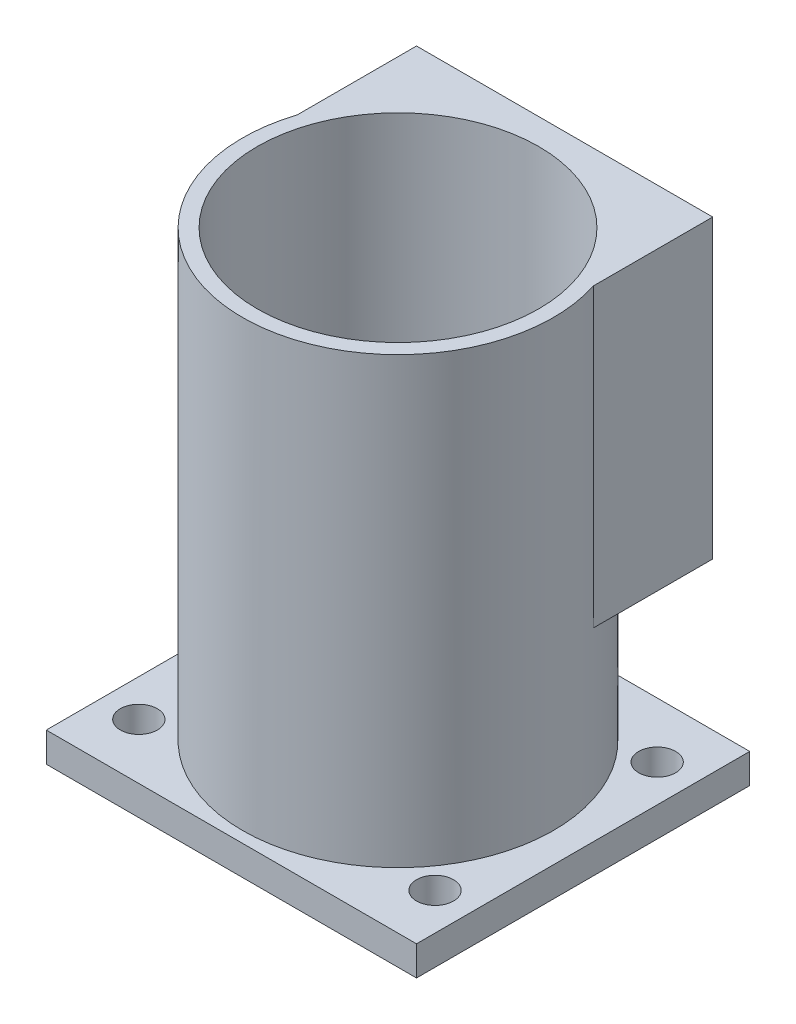
ISO-10303-21;
HEADER;
FILE_DESCRIPTION(('STEP AP214'),'2;1');
FILE_NAME('part.step','',(''),(''),'','','');
FILE_SCHEMA(('AUTOMOTIVE_DESIGN { 1 0 10303 214 1 1 1 1 }'));
ENDSEC;
DATA;
#1=APPLICATION_CONTEXT('core data for automotive mechanical design processes');
#2=APPLICATION_PROTOCOL_DEFINITION('international standard','automotive_design',2000,#1);
#3=PRODUCT_CONTEXT('',#1,'mechanical');
#4=PRODUCT('Part','Part','',(#3));
#5=PRODUCT_RELATED_PRODUCT_CATEGORY('part','',(#4));
#6=PRODUCT_DEFINITION_FORMATION('','',#4);
#7=PRODUCT_DEFINITION_CONTEXT('part definition',#1,'design');
#8=PRODUCT_DEFINITION('design','',#6,#7);
#9=PRODUCT_DEFINITION_SHAPE('','',#8);
#10=(LENGTH_UNIT() NAMED_UNIT(*) SI_UNIT(.MILLI.,.METRE.));
#11=(NAMED_UNIT(*) PLANE_ANGLE_UNIT() SI_UNIT($,.RADIAN.));
#12=(NAMED_UNIT(*) SI_UNIT($,.STERADIAN.) SOLID_ANGLE_UNIT());
#13=UNCERTAINTY_MEASURE_WITH_UNIT(LENGTH_MEASURE(1.E-05),#10,'distance_accuracy_value','');
#14=(GEOMETRIC_REPRESENTATION_CONTEXT(3) GLOBAL_UNCERTAINTY_ASSIGNED_CONTEXT((#13)) GLOBAL_UNIT_ASSIGNED_CONTEXT((#10,
#11,#12)) REPRESENTATION_CONTEXT('',''));
#15=CARTESIAN_POINT('',(0.,0.,0.));
#16=DIRECTION('',(0.,0.,1.));
#17=DIRECTION('',(1.,0.,0.));
#18=AXIS2_PLACEMENT_3D('',#15,#16,#17);
#19=CARTESIAN_POINT('',(0.,5.08,0.));
#20=DIRECTION('',(0.,1.,0.));
#21=DIRECTION('',(0.,0.,1.));
#22=AXIS2_PLACEMENT_3D('',#19,#20,#21);
#23=PLANE('',#22);
#24=CARTESIAN_POINT('',(31.75,5.08,28.575));
#25=DIRECTION('',(0.,1.,0.));
#26=DIRECTION('',(0.,0.,1.));
#27=AXIS2_PLACEMENT_3D('',#24,#25,#26);
#28=CIRCLE('',#27,26.67);
#29=CARTESIAN_POINT('',(31.75,5.08,55.245));
#30=VERTEX_POINT('',#29);
#31=EDGE_CURVE('E141',#30,#30,#28,.T.);
#32=ORIENTED_EDGE('',*,*,#31,.F.);
#33=EDGE_LOOP('',(#32));
#34=FACE_BOUND('',#33,.T.);
#35=CARTESIAN_POINT('',(57.15,5.08,47.625));
#36=DIRECTION('',(0.,1.,0.));
#37=DIRECTION('',(0.,0.,-1.));
#38=AXIS2_PLACEMENT_3D('',#35,#36,#37);
#39=CIRCLE('',#38,3.175);
#40=CARTESIAN_POINT('',(57.15,5.08,44.45));
#41=VERTEX_POINT('',#40);
#42=EDGE_CURVE('E155',#41,#41,#39,.T.);
#43=ORIENTED_EDGE('',*,*,#42,.F.);
#44=EDGE_LOOP('',(#43));
#45=FACE_BOUND('',#44,.T.);
#46=CARTESIAN_POINT('',(6.35,5.08,9.525));
#47=DIRECTION('',(0.,1.,0.));
#48=DIRECTION('',(0.,0.,1.));
#49=AXIS2_PLACEMENT_3D('',#46,#47,#48);
#50=CIRCLE('',#49,3.175);
#51=CARTESIAN_POINT('',(6.35,5.08,12.7));
#52=VERTEX_POINT('',#51);
#53=EDGE_CURVE('E167',#52,#52,#50,.T.);
#54=ORIENTED_EDGE('',*,*,#53,.F.);
#55=EDGE_LOOP('',(#54));
#56=FACE_BOUND('',#55,.T.);
#57=DIRECTION('',(0.,0.,1.));
#58=VECTOR('',#57,1.);
#59=CARTESIAN_POINT('',(0.,5.08,0.));
#60=LINE('',#59,#58);
#61=CARTESIAN_POINT('',(0.,5.08,0.));
#62=VERTEX_POINT('',#61);
#63=CARTESIAN_POINT('',(0.,5.08,57.15));
#64=VERTEX_POINT('',#63);
#65=EDGE_CURVE('E173',#62,#64,#60,.T.);
#66=ORIENTED_EDGE('',*,*,#65,.T.);
#67=DIRECTION('',(1.,0.,0.));
#68=VECTOR('',#67,1.);
#69=CARTESIAN_POINT('',(0.,5.08,57.15));
#70=LINE('',#69,#68);
#71=CARTESIAN_POINT('',(63.5,5.08,57.15));
#72=VERTEX_POINT('',#71);
#73=EDGE_CURVE('E92',#64,#72,#70,.T.);
#74=ORIENTED_EDGE('',*,*,#73,.T.);
#75=DIRECTION('',(0.,0.,-1.));
#76=VECTOR('',#75,1.);
#77=CARTESIAN_POINT('',(63.5,5.08,0.));
#78=LINE('',#77,#76);
#79=CARTESIAN_POINT('',(63.5,5.08,0.));
#80=VERTEX_POINT('',#79);
#81=EDGE_CURVE('E176',#72,#80,#78,.T.);
#82=ORIENTED_EDGE('',*,*,#81,.T.);
#83=DIRECTION('',(-1.,0.,0.));
#84=VECTOR('',#83,1.);
#85=CARTESIAN_POINT('',(0.,5.08,0.));
#86=LINE('',#85,#84);
#87=EDGE_CURVE('E63',#80,#62,#86,.T.);
#88=ORIENTED_EDGE('',*,*,#87,.T.);
#89=EDGE_LOOP('',(#66,#74,#82,#88));
#90=FACE_BOUND('',#89,.T.);
#91=CARTESIAN_POINT('',(57.15,5.08,9.525));
#92=DIRECTION('',(0.,1.,0.));
#93=DIRECTION('',(0.,0.,1.));
#94=AXIS2_PLACEMENT_3D('',#91,#92,#93);
#95=CIRCLE('',#94,3.175);
#96=CARTESIAN_POINT('',(57.15,5.08,12.7));
#97=VERTEX_POINT('',#96);
#98=EDGE_CURVE('E161',#97,#97,#95,.T.);
#99=ORIENTED_EDGE('',*,*,#98,.F.);
#100=EDGE_LOOP('',(#99));
#101=FACE_BOUND('',#100,.T.);
#102=CARTESIAN_POINT('',(6.35,5.08,47.625));
#103=DIRECTION('',(0.,1.,0.));
#104=DIRECTION('',(0.,0.,-1.));
#105=AXIS2_PLACEMENT_3D('',#102,#103,#104);
#106=CIRCLE('',#105,3.175);
#107=CARTESIAN_POINT('',(6.35,5.08,44.45));
#108=VERTEX_POINT('',#107);
#109=EDGE_CURVE('E144',#108,#108,#106,.T.);
#110=ORIENTED_EDGE('',*,*,#109,.F.);
#111=EDGE_LOOP('',(#110));
#112=FACE_BOUND('',#111,.T.);
#113=ADVANCED_FACE('F39',(#34,#45,#56,#90,#101,#112),#23,.T.);
#114=CARTESIAN_POINT('',(0.,0.,0.));
#115=DIRECTION('',(0.,1.,0.));
#116=DIRECTION('',(0.,0.,1.));
#117=AXIS2_PLACEMENT_3D('',#114,#115,#116);
#118=PLANE('',#117);
#119=DIRECTION('',(0.,0.,1.));
#120=VECTOR('',#119,1.);
#121=CARTESIAN_POINT('',(0.,0.,0.));
#122=LINE('',#121,#120);
#123=CARTESIAN_POINT('',(0.,0.,0.));
#124=VERTEX_POINT('',#123);
#125=CARTESIAN_POINT('',(0.,0.,57.15));
#126=VERTEX_POINT('',#125);
#127=EDGE_CURVE('E170',#124,#126,#122,.T.);
#128=ORIENTED_EDGE('',*,*,#127,.F.);
#129=DIRECTION('',(-1.,0.,0.));
#130=VECTOR('',#129,1.);
#131=CARTESIAN_POINT('',(0.,0.,0.));
#132=LINE('',#131,#130);
#133=CARTESIAN_POINT('',(63.5,0.,0.));
#134=VERTEX_POINT('',#133);
#135=EDGE_CURVE('E84',#134,#124,#132,.T.);
#136=ORIENTED_EDGE('',*,*,#135,.F.);
#137=DIRECTION('',(0.,0.,-1.));
#138=VECTOR('',#137,1.);
#139=CARTESIAN_POINT('',(63.5,0.,0.));
#140=LINE('',#139,#138);
#141=CARTESIAN_POINT('',(63.5,0.,57.15));
#142=VERTEX_POINT('',#141);
#143=EDGE_CURVE('E184',#142,#134,#140,.T.);
#144=ORIENTED_EDGE('',*,*,#143,.F.);
#145=DIRECTION('',(1.,0.,0.));
#146=VECTOR('',#145,1.);
#147=CARTESIAN_POINT('',(0.,0.,57.15));
#148=LINE('',#147,#146);
#149=EDGE_CURVE('E182',#126,#142,#148,.T.);
#150=ORIENTED_EDGE('',*,*,#149,.F.);
#151=EDGE_LOOP('',(#128,#136,#144,#150));
#152=FACE_BOUND('',#151,.T.);
#153=CARTESIAN_POINT('',(6.35,0.,9.525));
#154=DIRECTION('',(0.,1.,0.));
#155=DIRECTION('',(0.,0.,1.));
#156=AXIS2_PLACEMENT_3D('',#153,#154,#155);
#157=CIRCLE('',#156,3.175);
#158=CARTESIAN_POINT('',(6.35,0.,12.7));
#159=VERTEX_POINT('',#158);
#160=EDGE_CURVE('E164',#159,#159,#157,.T.);
#161=ORIENTED_EDGE('',*,*,#160,.T.);
#162=EDGE_LOOP('',(#161));
#163=FACE_BOUND('',#162,.T.);
#164=CARTESIAN_POINT('',(57.15,0.,9.525));
#165=DIRECTION('',(0.,1.,0.));
#166=DIRECTION('',(0.,0.,1.));
#167=AXIS2_PLACEMENT_3D('',#164,#165,#166);
#168=CIRCLE('',#167,3.175);
#169=CARTESIAN_POINT('',(57.15,0.,12.7));
#170=VERTEX_POINT('',#169);
#171=EDGE_CURVE('E158',#170,#170,#168,.T.);
#172=ORIENTED_EDGE('',*,*,#171,.T.);
#173=EDGE_LOOP('',(#172));
#174=FACE_BOUND('',#173,.T.);
#175=CARTESIAN_POINT('',(57.15,0.,47.625));
#176=DIRECTION('',(0.,1.,0.));
#177=DIRECTION('',(0.,0.,-1.));
#178=AXIS2_PLACEMENT_3D('',#175,#176,#177);
#179=CIRCLE('',#178,3.175);
#180=CARTESIAN_POINT('',(57.15,0.,44.45));
#181=VERTEX_POINT('',#180);
#182=EDGE_CURVE('E153',#181,#181,#179,.T.);
#183=ORIENTED_EDGE('',*,*,#182,.T.);
#184=EDGE_LOOP('',(#183));
#185=FACE_BOUND('',#184,.T.);
#186=CARTESIAN_POINT('',(6.35,0.,47.625));
#187=DIRECTION('',(0.,1.,0.));
#188=DIRECTION('',(0.,0.,-1.));
#189=AXIS2_PLACEMENT_3D('',#186,#187,#188);
#190=CIRCLE('',#189,3.175);
#191=CARTESIAN_POINT('',(6.35,0.,44.45));
#192=VERTEX_POINT('',#191);
#193=EDGE_CURVE('E140',#192,#192,#190,.T.);
#194=ORIENTED_EDGE('',*,*,#193,.T.);
#195=EDGE_LOOP('',(#194));
#196=FACE_BOUND('',#195,.T.);
#197=ADVANCED_FACE('F198',(#152,#163,#174,#185,#196),#118,.F.);
#198=CARTESIAN_POINT('',(0.,5.08,0.));
#199=DIRECTION('',(1.,0.,0.));
#200=DIRECTION('',(0.,0.,-1.));
#201=AXIS2_PLACEMENT_3D('',#198,#199,#200);
#202=PLANE('',#201);
#203=ORIENTED_EDGE('',*,*,#127,.T.);
#204=DIRECTION('',(0.,-1.,0.));
#205=VECTOR('',#204,1.);
#206=CARTESIAN_POINT('',(0.,5.08,57.15));
#207=LINE('',#206,#205);
#208=EDGE_CURVE('E47',#64,#126,#207,.T.);
#209=ORIENTED_EDGE('',*,*,#208,.F.);
#210=ORIENTED_EDGE('',*,*,#65,.F.);
#211=DIRECTION('',(0.,-1.,0.));
#212=VECTOR('',#211,1.);
#213=CARTESIAN_POINT('',(0.,5.08,0.));
#214=LINE('',#213,#212);
#215=EDGE_CURVE('E179',#62,#124,#214,.T.);
#216=ORIENTED_EDGE('',*,*,#215,.T.);
#217=EDGE_LOOP('',(#203,#209,#210,#216));
#218=FACE_BOUND('',#217,.T.);
#219=ADVANCED_FACE('F41',(#218),#202,.F.);
#220=CARTESIAN_POINT('',(0.,5.08,57.15));
#221=DIRECTION('',(0.,0.,-1.));
#222=DIRECTION('',(-1.,0.,0.));
#223=AXIS2_PLACEMENT_3D('',#220,#221,#222);
#224=PLANE('',#223);
#225=ORIENTED_EDGE('',*,*,#149,.T.);
#226=DIRECTION('',(0.,-1.,0.));
#227=VECTOR('',#226,1.);
#228=CARTESIAN_POINT('',(63.5,5.08,57.15));
#229=LINE('',#228,#227);
#230=EDGE_CURVE('E190',#72,#142,#229,.T.);
#231=ORIENTED_EDGE('',*,*,#230,.F.);
#232=ORIENTED_EDGE('',*,*,#73,.F.);
#233=ORIENTED_EDGE('',*,*,#208,.T.);
#234=EDGE_LOOP('',(#225,#231,#232,#233));
#235=FACE_BOUND('',#234,.T.);
#236=ADVANCED_FACE('F193',(#235),#224,.F.);
#237=CARTESIAN_POINT('',(63.5,5.08,0.));
#238=DIRECTION('',(-1.,0.,0.));
#239=DIRECTION('',(0.,0.,1.));
#240=AXIS2_PLACEMENT_3D('',#237,#238,#239);
#241=PLANE('',#240);
#242=ORIENTED_EDGE('',*,*,#143,.T.);
#243=DIRECTION('',(0.,-1.,0.));
#244=VECTOR('',#243,1.);
#245=CARTESIAN_POINT('',(63.5,5.08,0.));
#246=LINE('',#245,#244);
#247=EDGE_CURVE('E188',#80,#134,#246,.T.);
#248=ORIENTED_EDGE('',*,*,#247,.F.);
#249=ORIENTED_EDGE('',*,*,#81,.F.);
#250=ORIENTED_EDGE('',*,*,#230,.T.);
#251=EDGE_LOOP('',(#242,#248,#249,#250));
#252=FACE_BOUND('',#251,.T.);
#253=ADVANCED_FACE('F203',(#252),#241,.F.);
#254=CARTESIAN_POINT('',(0.,5.08,0.));
#255=DIRECTION('',(0.,0.,1.));
#256=DIRECTION('',(1.,0.,0.));
#257=AXIS2_PLACEMENT_3D('',#254,#255,#256);
#258=PLANE('',#257);
#259=ORIENTED_EDGE('',*,*,#135,.T.);
#260=ORIENTED_EDGE('',*,*,#215,.F.);
#261=ORIENTED_EDGE('',*,*,#87,.F.);
#262=ORIENTED_EDGE('',*,*,#247,.T.);
#263=EDGE_LOOP('',(#259,#260,#261,#262));
#264=FACE_BOUND('',#263,.T.);
#265=ADVANCED_FACE('F205',(#264),#258,.F.);
#266=CARTESIAN_POINT('',(6.35,5.08,9.525));
#267=DIRECTION('',(0.,-1.,0.));
#268=DIRECTION('',(0.,0.,-1.));
#269=AXIS2_PLACEMENT_3D('',#266,#267,#268);
#270=CYLINDRICAL_SURFACE('',#269,3.175);
#271=ORIENTED_EDGE('',*,*,#53,.T.);
#272=EDGE_LOOP('',(#271));
#273=FACE_BOUND('',#272,.T.);
#274=ORIENTED_EDGE('',*,*,#160,.F.);
#275=EDGE_LOOP('',(#274));
#276=FACE_BOUND('',#275,.T.);
#277=ADVANCED_FACE('F231',(#273,#276),#270,.F.);
#278=CARTESIAN_POINT('',(57.15,5.08,9.525));
#279=DIRECTION('',(0.,-1.,0.));
#280=DIRECTION('',(0.,0.,-1.));
#281=AXIS2_PLACEMENT_3D('',#278,#279,#280);
#282=CYLINDRICAL_SURFACE('',#281,3.175);
#283=ORIENTED_EDGE('',*,*,#98,.T.);
#284=EDGE_LOOP('',(#283));
#285=FACE_BOUND('',#284,.T.);
#286=ORIENTED_EDGE('',*,*,#171,.F.);
#287=EDGE_LOOP('',(#286));
#288=FACE_BOUND('',#287,.T.);
#289=ADVANCED_FACE('F252',(#285,#288),#282,.F.);
#290=CARTESIAN_POINT('',(57.15,5.08,47.625));
#291=DIRECTION('',(0.,-1.,0.));
#292=DIRECTION('',(0.,0.,-1.));
#293=AXIS2_PLACEMENT_3D('',#290,#291,#292);
#294=CYLINDRICAL_SURFACE('',#293,3.175);
#295=ORIENTED_EDGE('',*,*,#42,.T.);
#296=EDGE_LOOP('',(#295));
#297=FACE_BOUND('',#296,.T.);
#298=ORIENTED_EDGE('',*,*,#182,.F.);
#299=EDGE_LOOP('',(#298));
#300=FACE_BOUND('',#299,.T.);
#301=ADVANCED_FACE('F218',(#297,#300),#294,.F.);
#302=CARTESIAN_POINT('',(6.35,5.08,47.625));
#303=DIRECTION('',(0.,-1.,0.));
#304=DIRECTION('',(0.,0.,-1.));
#305=AXIS2_PLACEMENT_3D('',#302,#303,#304);
#306=CYLINDRICAL_SURFACE('',#305,3.175);
#307=ORIENTED_EDGE('',*,*,#109,.T.);
#308=EDGE_LOOP('',(#307));
#309=FACE_BOUND('',#308,.T.);
#310=ORIENTED_EDGE('',*,*,#193,.F.);
#311=EDGE_LOOP('',(#310));
#312=FACE_BOUND('',#311,.T.);
#313=ADVANCED_FACE('F215',(#309,#312),#306,.F.);
#314=CARTESIAN_POINT('',(31.75,81.28,28.575));
#315=DIRECTION('',(0.,1.,0.));
#316=DIRECTION('',(0.,0.,1.));
#317=AXIS2_PLACEMENT_3D('',#314,#315,#316);
#318=PLANE('',#317);
#319=CARTESIAN_POINT('',(31.75,81.28,28.575));
#320=DIRECTION('',(0.,1.,0.));
#321=DIRECTION('',(0.,0.,1.));
#322=AXIS2_PLACEMENT_3D('',#319,#320,#321);
#323=CIRCLE('',#322,26.67);
#324=CARTESIAN_POINT('',(6.35000000000001,81.28,20.4430322184603));
#325=VERTEX_POINT('',#324);
#326=CARTESIAN_POINT('',(57.15,81.28,20.4430322184603));
#327=VERTEX_POINT('',#326);
#328=EDGE_CURVE('E120',#325,#327,#323,.T.);
#329=ORIENTED_EDGE('',*,*,#328,.T.);
#330=DIRECTION('',(0.,0.,-1.));
#331=VECTOR('',#330,1.);
#332=CARTESIAN_POINT('',(57.15,81.28,57.151));
#333=LINE('',#332,#331);
#334=CARTESIAN_POINT('',(57.15,81.28,0.));
#335=VERTEX_POINT('',#334);
#336=EDGE_CURVE('E134',#327,#335,#333,.T.);
#337=ORIENTED_EDGE('',*,*,#336,.T.);
#338=DIRECTION('',(1.,0.,0.));
#339=VECTOR('',#338,1.);
#340=CARTESIAN_POINT('',(57.15,81.28,0.));
#341=LINE('',#340,#339);
#342=CARTESIAN_POINT('',(6.35000000000001,81.28,0.));
#343=VERTEX_POINT('',#342);
#344=EDGE_CURVE('E122',#343,#335,#341,.T.);
#345=ORIENTED_EDGE('',*,*,#344,.F.);
#346=DIRECTION('',(0.,0.,-1.));
#347=VECTOR('',#346,1.);
#348=CARTESIAN_POINT('',(6.35000000000001,81.28,57.151));
#349=LINE('',#348,#347);
#350=EDGE_CURVE('E115',#325,#343,#349,.T.);
#351=ORIENTED_EDGE('',*,*,#350,.F.);
#352=EDGE_LOOP('',(#329,#337,#345,#351));
#353=FACE_BOUND('',#352,.T.);
#354=CARTESIAN_POINT('',(31.75,81.28,28.575));
#355=DIRECTION('',(0.,1.,0.));
#356=DIRECTION('',(0.,0.,1.));
#357=AXIS2_PLACEMENT_3D('',#354,#355,#356);
#358=CIRCLE('',#357,24.13);
#359=CARTESIAN_POINT('',(31.75,81.28,52.705));
#360=VERTEX_POINT('',#359);
#361=EDGE_CURVE('E147',#360,#360,#358,.T.);
#362=ORIENTED_EDGE('',*,*,#361,.F.);
#363=EDGE_LOOP('',(#362));
#364=FACE_BOUND('',#363,.T.);
#365=ADVANCED_FACE('F117',(#353,#364),#318,.T.);
#366=CARTESIAN_POINT('',(31.75,81.28,28.575));
#367=DIRECTION('',(0.,-1.,0.));
#368=DIRECTION('',(0.,0.,-1.));
#369=AXIS2_PLACEMENT_3D('',#366,#367,#368);
#370=CYLINDRICAL_SURFACE('',#369,26.67);
#371=CARTESIAN_POINT('',(31.75,30.48,28.575));
#372=DIRECTION('',(0.,-1.,0.));
#373=DIRECTION('',(1.,0.,0.));
#374=AXIS2_PLACEMENT_3D('',#371,#372,#373);
#375=CIRCLE('',#374,26.67);
#376=CARTESIAN_POINT('',(57.15,30.48,20.4430322184603));
#377=VERTEX_POINT('',#376);
#378=CARTESIAN_POINT('',(6.35,30.48,20.4430322184603));
#379=VERTEX_POINT('',#378);
#380=EDGE_CURVE('E126',#377,#379,#375,.F.);
#381=ORIENTED_EDGE('',*,*,#380,.F.);
#382=DIRECTION('',(0.,-1.,0.));
#383=VECTOR('',#382,1.);
#384=CARTESIAN_POINT('',(57.15,81.28,20.4430322184603));
#385=LINE('',#384,#383);
#386=EDGE_CURVE('E139',#327,#377,#385,.T.);
#387=ORIENTED_EDGE('',*,*,#386,.F.);
#388=ORIENTED_EDGE('',*,*,#328,.F.);
#389=DIRECTION('',(0.,-1.,0.));
#390=VECTOR('',#389,1.);
#391=CARTESIAN_POINT('',(6.35000000000001,81.28,20.4430322184603));
#392=LINE('',#391,#390);
#393=EDGE_CURVE('E127',#379,#325,#392,.F.);
#394=ORIENTED_EDGE('',*,*,#393,.F.);
#395=EDGE_LOOP('',(#381,#387,#388,#394));
#396=FACE_BOUND('',#395,.T.);
#397=ORIENTED_EDGE('',*,*,#31,.T.);
#398=EDGE_LOOP('',(#397));
#399=FACE_BOUND('',#398,.T.);
#400=ADVANCED_FACE('F137',(#396,#399),#370,.T.);
#401=CARTESIAN_POINT('',(31.75,81.28,28.575));
#402=DIRECTION('',(0.,-1.,0.));
#403=DIRECTION('',(0.,0.,-1.));
#404=AXIS2_PLACEMENT_3D('',#401,#402,#403);
#405=CYLINDRICAL_SURFACE('',#404,24.13);
#406=ORIENTED_EDGE('',*,*,#361,.T.);
#407=EDGE_LOOP('',(#406));
#408=FACE_BOUND('',#407,.T.);
#409=CARTESIAN_POINT('',(31.75,5.08,28.575));
#410=DIRECTION('',(0.,1.,0.));
#411=DIRECTION('',(0.,0.,1.));
#412=AXIS2_PLACEMENT_3D('',#409,#410,#411);
#413=CIRCLE('',#412,24.13);
#414=CARTESIAN_POINT('',(31.75,5.08,52.705));
#415=VERTEX_POINT('',#414);
#416=EDGE_CURVE('E12',#415,#415,#413,.F.);
#417=ORIENTED_EDGE('',*,*,#416,.T.);
#418=EDGE_LOOP('',(#417));
#419=FACE_BOUND('',#418,.T.);
#420=ADVANCED_FACE('F279',(#408,#419),#405,.F.);
#421=ORIENTED_EDGE('',*,*,#416,.F.);
#422=EDGE_LOOP('',(#421));
#423=FACE_BOUND('',#422,.T.);
#424=ADVANCED_FACE('F210',(#423),#23,.T.);
#425=CARTESIAN_POINT('',(57.15,81.28,57.151));
#426=DIRECTION('',(1.,0.,0.));
#427=DIRECTION('',(0.,1.,0.));
#428=AXIS2_PLACEMENT_3D('',#425,#426,#427);
#429=PLANE('',#428);
#430=ORIENTED_EDGE('',*,*,#336,.F.);
#431=ORIENTED_EDGE('',*,*,#386,.T.);
#432=DIRECTION('',(0.,0.,-1.));
#433=VECTOR('',#432,1.);
#434=CARTESIAN_POINT('',(57.15,30.48,57.151));
#435=LINE('',#434,#433);
#436=CARTESIAN_POINT('',(57.15,30.48,0.));
#437=VERTEX_POINT('',#436);
#438=EDGE_CURVE('E54',#377,#437,#435,.T.);
#439=ORIENTED_EDGE('',*,*,#438,.T.);
#440=DIRECTION('',(0.,-1.,0.));
#441=VECTOR('',#440,1.);
#442=CARTESIAN_POINT('',(57.15,81.28,0.));
#443=LINE('',#442,#441);
#444=EDGE_CURVE('E378',#335,#437,#443,.T.);
#445=ORIENTED_EDGE('',*,*,#444,.F.);
#446=EDGE_LOOP('',(#430,#431,#439,#445));
#447=FACE_BOUND('',#446,.T.);
#448=ADVANCED_FACE('F297',(#447),#429,.T.);
#449=CARTESIAN_POINT('',(6.35000000000001,81.28,57.151));
#450=DIRECTION('',(-1.,0.,0.));
#451=DIRECTION('',(0.,-1.,0.));
#452=AXIS2_PLACEMENT_3D('',#449,#450,#451);
#453=PLANE('',#452);
#454=DIRECTION('',(0.,0.,-1.));
#455=VECTOR('',#454,1.);
#456=CARTESIAN_POINT('',(6.35,30.48,57.151));
#457=LINE('',#456,#455);
#458=CARTESIAN_POINT('',(6.35,30.48,0.));
#459=VERTEX_POINT('',#458);
#460=EDGE_CURVE('E131',#379,#459,#457,.T.);
#461=ORIENTED_EDGE('',*,*,#460,.F.);
#462=ORIENTED_EDGE('',*,*,#393,.T.);
#463=ORIENTED_EDGE('',*,*,#350,.T.);
#464=DIRECTION('',(0.,1.,0.));
#465=VECTOR('',#464,1.);
#466=CARTESIAN_POINT('',(6.35000000000001,81.28,0.));
#467=LINE('',#466,#465);
#468=EDGE_CURVE('E381',#459,#343,#467,.T.);
#469=ORIENTED_EDGE('',*,*,#468,.F.);
#470=EDGE_LOOP('',(#461,#462,#463,#469));
#471=FACE_BOUND('',#470,.T.);
#472=ADVANCED_FACE('F130',(#471),#453,.T.);
#473=CARTESIAN_POINT('',(57.15,30.48,57.151));
#474=DIRECTION('',(0.,-1.,0.));
#475=DIRECTION('',(1.,0.,0.));
#476=AXIS2_PLACEMENT_3D('',#473,#474,#475);
#477=PLANE('',#476);
#478=ORIENTED_EDGE('',*,*,#438,.F.);
#479=ORIENTED_EDGE('',*,*,#380,.T.);
#480=ORIENTED_EDGE('',*,*,#460,.T.);
#481=DIRECTION('',(-1.,0.,0.));
#482=VECTOR('',#481,1.);
#483=CARTESIAN_POINT('',(57.15,30.48,0.));
#484=LINE('',#483,#482);
#485=EDGE_CURVE('E379',#437,#459,#484,.T.);
#486=ORIENTED_EDGE('',*,*,#485,.F.);
#487=EDGE_LOOP('',(#478,#479,#480,#486));
#488=FACE_BOUND('',#487,.T.);
#489=ADVANCED_FACE('F315',(#488),#477,.T.);
#490=CARTESIAN_POINT('',(0.,0.,0.));
#491=DIRECTION('',(0.,0.,-1.));
#492=DIRECTION('',(-1.,0.,0.));
#493=AXIS2_PLACEMENT_3D('',#490,#491,#492);
#494=PLANE('',#493);
#495=ORIENTED_EDGE('',*,*,#444,.T.);
#496=ORIENTED_EDGE('',*,*,#485,.T.);
#497=ORIENTED_EDGE('',*,*,#468,.T.);
#498=ORIENTED_EDGE('',*,*,#344,.T.);
#499=EDGE_LOOP('',(#495,#496,#497,#498));
#500=FACE_BOUND('',#499,.T.);
#501=ADVANCED_FACE('F322',(#500),#494,.T.);
#502=CLOSED_SHELL('',(#113,#197,#219,#236,#253,#265,#277,#289,#301,#313,#365,#400,#420,#424,
#448,#472,#489,#501));
#503=MANIFOLD_SOLID_BREP('B2',#502);
#504=ADVANCED_BREP_SHAPE_REPRESENTATION('',(#18,#503),#14);
#505=SHAPE_DEFINITION_REPRESENTATION(#9,#504);
ENDSEC;
END-ISO-10303-21;
